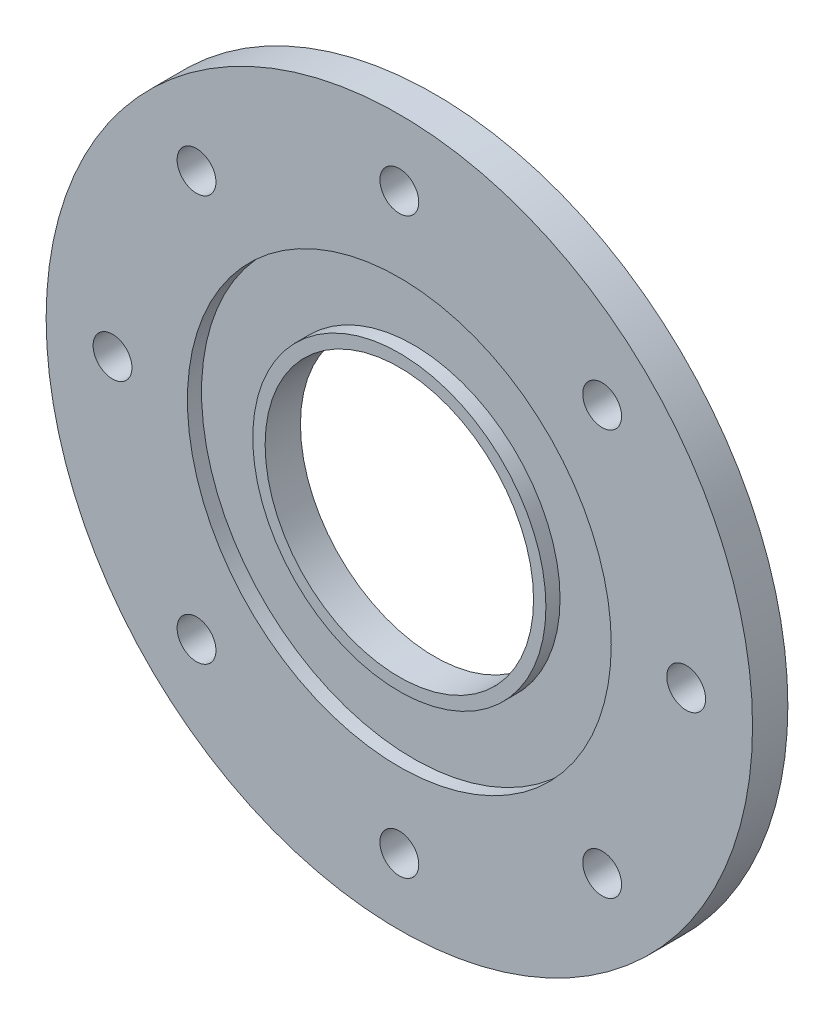
ISO-10303-21;
HEADER;
FILE_DESCRIPTION(('STEP AP214'),'2;1');
FILE_NAME('part.step','',(''),(''),'','','');
FILE_SCHEMA(('AUTOMOTIVE_DESIGN { 1 0 10303 214 1 1 1 1 }'));
ENDSEC;
DATA;
#1=APPLICATION_CONTEXT('core data for automotive mechanical design processes');
#2=APPLICATION_PROTOCOL_DEFINITION('international standard','automotive_design',2000,#1);
#3=PRODUCT_CONTEXT('',#1,'mechanical');
#4=PRODUCT('Part','Part','',(#3));
#5=PRODUCT_RELATED_PRODUCT_CATEGORY('part','',(#4));
#6=PRODUCT_DEFINITION_FORMATION('','',#4);
#7=PRODUCT_DEFINITION_CONTEXT('part definition',#1,'design');
#8=PRODUCT_DEFINITION('design','',#6,#7);
#9=PRODUCT_DEFINITION_SHAPE('','',#8);
#10=(LENGTH_UNIT() NAMED_UNIT(*) SI_UNIT(.MILLI.,.METRE.));
#11=(NAMED_UNIT(*) PLANE_ANGLE_UNIT() SI_UNIT($,.RADIAN.));
#12=(NAMED_UNIT(*) SI_UNIT($,.STERADIAN.) SOLID_ANGLE_UNIT());
#13=UNCERTAINTY_MEASURE_WITH_UNIT(LENGTH_MEASURE(1.E-05),#10,'distance_accuracy_value','');
#14=(GEOMETRIC_REPRESENTATION_CONTEXT(3) GLOBAL_UNCERTAINTY_ASSIGNED_CONTEXT((#13)) GLOBAL_UNIT_ASSIGNED_CONTEXT((#10,
#11,#12)) REPRESENTATION_CONTEXT('',''));
#15=CARTESIAN_POINT('',(0.,0.,0.));
#16=DIRECTION('',(0.,0.,1.));
#17=DIRECTION('',(1.,0.,0.));
#18=AXIS2_PLACEMENT_3D('',#15,#16,#17);
#19=CARTESIAN_POINT('',(0.,0.,5.));
#20=DIRECTION('',(0.,0.,1.));
#21=DIRECTION('',(1.,0.,0.));
#22=AXIS2_PLACEMENT_3D('',#19,#20,#21);
#23=PLANE('',#22);
#24=CARTESIAN_POINT('',(0.,0.,5.));
#25=DIRECTION('',(0.,0.,1.));
#26=DIRECTION('',(1.,0.,0.));
#27=AXIS2_PLACEMENT_3D('',#24,#25,#26);
#28=CIRCLE('',#27,19.);
#29=CARTESIAN_POINT('',(19.,0.,5.));
#30=VERTEX_POINT('',#29);
#31=EDGE_CURVE('E41',#30,#30,#28,.T.);
#32=ORIENTED_EDGE('',*,*,#31,.F.);
#33=EDGE_LOOP('',(#32));
#34=FACE_BOUND('',#33,.T.);
#35=CARTESIAN_POINT('',(0.,0.,5.));
#36=DIRECTION('',(0.,0.,1.));
#37=DIRECTION('',(1.,0.,0.));
#38=AXIS2_PLACEMENT_3D('',#35,#36,#37);
#39=CIRCLE('',#38,20.75);
#40=CARTESIAN_POINT('',(20.75,0.,5.));
#41=VERTEX_POINT('',#40);
#42=EDGE_CURVE('E55',#41,#41,#39,.T.);
#43=ORIENTED_EDGE('',*,*,#42,.T.);
#44=EDGE_LOOP('',(#43));
#45=FACE_BOUND('',#44,.T.);
#46=ADVANCED_FACE('F30',(#34,#45),#23,.T.);
#47=CARTESIAN_POINT('',(28.7106551721743,-28.7106551721744,5.));
#48=DIRECTION('',(0.,0.,1.));
#49=DIRECTION('',(1.,0.,0.));
#50=AXIS2_PLACEMENT_3D('',#47,#48,#49);
#51=CIRCLE('',#50,2.75);
#52=CARTESIAN_POINT('',(31.4606551721743,-28.7106551721744,5.));
#53=VERTEX_POINT('',#52);
#54=EDGE_CURVE('E102',#53,#53,#51,.T.);
#55=ORIENTED_EDGE('',*,*,#54,.F.);
#56=EDGE_LOOP('',(#55));
#57=FACE_BOUND('',#56,.T.);
#58=CARTESIAN_POINT('',(-1.41764609570561E-13,-40.6029979291063,5.));
#59=DIRECTION('',(0.,0.,1.));
#60=DIRECTION('',(1.,0.,0.));
#61=AXIS2_PLACEMENT_3D('',#58,#59,#60);
#62=CIRCLE('',#61,2.75);
#63=CARTESIAN_POINT('',(2.74999999999986,-40.6029979291063,5.));
#64=VERTEX_POINT('',#63);
#65=EDGE_CURVE('E96',#64,#64,#62,.T.);
#66=ORIENTED_EDGE('',*,*,#65,.F.);
#67=EDGE_LOOP('',(#66));
#68=FACE_BOUND('',#67,.T.);
#69=CARTESIAN_POINT('',(-28.7106551721745,-28.7106551721742,5.));
#70=DIRECTION('',(0.,0.,1.));
#71=DIRECTION('',(1.,0.,0.));
#72=AXIS2_PLACEMENT_3D('',#69,#70,#71);
#73=CIRCLE('',#72,2.75);
#74=CARTESIAN_POINT('',(-25.9606551721745,-28.7106551721742,5.));
#75=VERTEX_POINT('',#74);
#76=EDGE_CURVE('E90',#75,#75,#73,.T.);
#77=ORIENTED_EDGE('',*,*,#76,.F.);
#78=EDGE_LOOP('',(#77));
#79=FACE_BOUND('',#78,.T.);
#80=CARTESIAN_POINT('',(-40.6029979291063,2.83529219141122E-13,5.));
#81=DIRECTION('',(0.,0.,1.));
#82=DIRECTION('',(1.,0.,0.));
#83=AXIS2_PLACEMENT_3D('',#80,#81,#82);
#84=CIRCLE('',#83,2.75);
#85=CARTESIAN_POINT('',(-37.8529979291063,2.83529219141122E-13,5.));
#86=VERTEX_POINT('',#85);
#87=EDGE_CURVE('E84',#86,#86,#84,.T.);
#88=ORIENTED_EDGE('',*,*,#87,.F.);
#89=EDGE_LOOP('',(#88));
#90=FACE_BOUND('',#89,.T.);
#91=CARTESIAN_POINT('',(-28.7106551721741,28.7106551721746,5.));
#92=DIRECTION('',(0.,0.,1.));
#93=DIRECTION('',(1.,0.,0.));
#94=AXIS2_PLACEMENT_3D('',#91,#92,#93);
#95=CIRCLE('',#94,2.75);
#96=CARTESIAN_POINT('',(-25.9606551721741,28.7106551721746,5.));
#97=VERTEX_POINT('',#96);
#98=EDGE_CURVE('E78',#97,#97,#95,.T.);
#99=ORIENTED_EDGE('',*,*,#98,.F.);
#100=EDGE_LOOP('',(#99));
#101=FACE_BOUND('',#100,.T.);
#102=CARTESIAN_POINT('',(4.25293828711683E-13,40.6029979291063,5.));
#103=DIRECTION('',(0.,0.,1.));
#104=DIRECTION('',(1.,0.,0.));
#105=AXIS2_PLACEMENT_3D('',#102,#103,#104);
#106=CIRCLE('',#105,2.75);
#107=CARTESIAN_POINT('',(2.75000000000043,40.6029979291063,5.));
#108=VERTEX_POINT('',#107);
#109=EDGE_CURVE('E72',#108,#108,#106,.T.);
#110=ORIENTED_EDGE('',*,*,#109,.F.);
#111=EDGE_LOOP('',(#110));
#112=FACE_BOUND('',#111,.T.);
#113=CARTESIAN_POINT('',(28.7106551721747,28.710655172174,5.));
#114=DIRECTION('',(0.,0.,1.));
#115=DIRECTION('',(1.,0.,0.));
#116=AXIS2_PLACEMENT_3D('',#113,#114,#115);
#117=CIRCLE('',#116,2.75);
#118=CARTESIAN_POINT('',(31.4606551721747,28.710655172174,5.));
#119=VERTEX_POINT('',#118);
#120=EDGE_CURVE('E66',#119,#119,#117,.T.);
#121=ORIENTED_EDGE('',*,*,#120,.F.);
#122=EDGE_LOOP('',(#121));
#123=FACE_BOUND('',#122,.T.);
#124=CARTESIAN_POINT('',(40.6029979291063,0.,5.));
#125=DIRECTION('',(0.,0.,1.));
#126=DIRECTION('',(1.,0.,0.));
#127=AXIS2_PLACEMENT_3D('',#124,#125,#126);
#128=CIRCLE('',#127,2.75);
#129=CARTESIAN_POINT('',(43.3529979291063,0.,5.));
#130=VERTEX_POINT('',#129);
#131=EDGE_CURVE('E63',#130,#130,#128,.T.);
#132=ORIENTED_EDGE('',*,*,#131,.F.);
#133=EDGE_LOOP('',(#132));
#134=FACE_BOUND('',#133,.T.);
#135=CARTESIAN_POINT('',(0.,0.,5.));
#136=DIRECTION('',(0.,0.,1.));
#137=DIRECTION('',(1.,0.,0.));
#138=AXIS2_PLACEMENT_3D('',#135,#136,#137);
#139=CIRCLE('',#138,30.);
#140=CARTESIAN_POINT('',(30.,0.,5.));
#141=VERTEX_POINT('',#140);
#142=EDGE_CURVE('E49',#141,#141,#139,.T.);
#143=ORIENTED_EDGE('',*,*,#142,.F.);
#144=EDGE_LOOP('',(#143));
#145=FACE_BOUND('',#144,.T.);
#146=CARTESIAN_POINT('',(0.,0.,5.));
#147=DIRECTION('',(0.,0.,1.));
#148=DIRECTION('',(1.,0.,0.));
#149=AXIS2_PLACEMENT_3D('',#146,#147,#148);
#150=CIRCLE('',#149,50.);
#151=CARTESIAN_POINT('',(50.,0.,5.));
#152=VERTEX_POINT('',#151);
#153=EDGE_CURVE('E10',#152,#152,#150,.T.);
#154=ORIENTED_EDGE('',*,*,#153,.T.);
#155=EDGE_LOOP('',(#154));
#156=FACE_BOUND('',#155,.T.);
#157=ADVANCED_FACE('F115',(#57,#68,#79,#90,#101,#112,#123,#134,#145,#156),#23,.T.);
#158=CARTESIAN_POINT('',(0.,0.,0.));
#159=DIRECTION('',(0.,0.,1.));
#160=DIRECTION('',(1.,0.,0.));
#161=AXIS2_PLACEMENT_3D('',#158,#159,#160);
#162=PLANE('',#161);
#163=CARTESIAN_POINT('',(28.7106551721743,-28.7106551721744,0.));
#164=DIRECTION('',(0.,0.,1.));
#165=DIRECTION('',(1.,0.,0.));
#166=AXIS2_PLACEMENT_3D('',#163,#164,#165);
#167=CIRCLE('',#166,2.75);
#168=CARTESIAN_POINT('',(31.4606551721743,-28.7106551721744,0.));
#169=VERTEX_POINT('',#168);
#170=EDGE_CURVE('E105',#169,#169,#167,.F.);
#171=ORIENTED_EDGE('',*,*,#170,.F.);
#172=EDGE_LOOP('',(#171));
#173=FACE_BOUND('',#172,.T.);
#174=CARTESIAN_POINT('',(-1.41764609570561E-13,-40.6029979291063,0.));
#175=DIRECTION('',(0.,0.,1.));
#176=DIRECTION('',(1.,0.,0.));
#177=AXIS2_PLACEMENT_3D('',#174,#175,#176);
#178=CIRCLE('',#177,2.75);
#179=CARTESIAN_POINT('',(2.74999999999986,-40.6029979291063,0.));
#180=VERTEX_POINT('',#179);
#181=EDGE_CURVE('E99',#180,#180,#178,.F.);
#182=ORIENTED_EDGE('',*,*,#181,.F.);
#183=EDGE_LOOP('',(#182));
#184=FACE_BOUND('',#183,.T.);
#185=CARTESIAN_POINT('',(-28.7106551721745,-28.7106551721742,0.));
#186=DIRECTION('',(0.,0.,1.));
#187=DIRECTION('',(1.,0.,0.));
#188=AXIS2_PLACEMENT_3D('',#185,#186,#187);
#189=CIRCLE('',#188,2.75);
#190=CARTESIAN_POINT('',(-25.9606551721745,-28.7106551721742,0.));
#191=VERTEX_POINT('',#190);
#192=EDGE_CURVE('E93',#191,#191,#189,.F.);
#193=ORIENTED_EDGE('',*,*,#192,.F.);
#194=EDGE_LOOP('',(#193));
#195=FACE_BOUND('',#194,.T.);
#196=CARTESIAN_POINT('',(-40.6029979291063,2.83529219141122E-13,0.));
#197=DIRECTION('',(0.,0.,1.));
#198=DIRECTION('',(1.,0.,0.));
#199=AXIS2_PLACEMENT_3D('',#196,#197,#198);
#200=CIRCLE('',#199,2.75);
#201=CARTESIAN_POINT('',(-37.8529979291063,2.83529219141122E-13,0.));
#202=VERTEX_POINT('',#201);
#203=EDGE_CURVE('E87',#202,#202,#200,.F.);
#204=ORIENTED_EDGE('',*,*,#203,.F.);
#205=EDGE_LOOP('',(#204));
#206=FACE_BOUND('',#205,.T.);
#207=CARTESIAN_POINT('',(-28.7106551721741,28.7106551721746,0.));
#208=DIRECTION('',(0.,0.,1.));
#209=DIRECTION('',(1.,0.,0.));
#210=AXIS2_PLACEMENT_3D('',#207,#208,#209);
#211=CIRCLE('',#210,2.75);
#212=CARTESIAN_POINT('',(-25.9606551721741,28.7106551721746,0.));
#213=VERTEX_POINT('',#212);
#214=EDGE_CURVE('E81',#213,#213,#211,.F.);
#215=ORIENTED_EDGE('',*,*,#214,.F.);
#216=EDGE_LOOP('',(#215));
#217=FACE_BOUND('',#216,.T.);
#218=CARTESIAN_POINT('',(4.25293828711683E-13,40.6029979291063,0.));
#219=DIRECTION('',(0.,0.,1.));
#220=DIRECTION('',(1.,0.,0.));
#221=AXIS2_PLACEMENT_3D('',#218,#219,#220);
#222=CIRCLE('',#221,2.75);
#223=CARTESIAN_POINT('',(2.75000000000043,40.6029979291063,0.));
#224=VERTEX_POINT('',#223);
#225=EDGE_CURVE('E75',#224,#224,#222,.F.);
#226=ORIENTED_EDGE('',*,*,#225,.F.);
#227=EDGE_LOOP('',(#226));
#228=FACE_BOUND('',#227,.T.);
#229=CARTESIAN_POINT('',(28.7106551721747,28.710655172174,0.));
#230=DIRECTION('',(0.,0.,1.));
#231=DIRECTION('',(1.,0.,0.));
#232=AXIS2_PLACEMENT_3D('',#229,#230,#231);
#233=CIRCLE('',#232,2.75);
#234=CARTESIAN_POINT('',(31.4606551721747,28.710655172174,0.));
#235=VERTEX_POINT('',#234);
#236=EDGE_CURVE('E69',#235,#235,#233,.F.);
#237=ORIENTED_EDGE('',*,*,#236,.F.);
#238=EDGE_LOOP('',(#237));
#239=FACE_BOUND('',#238,.T.);
#240=CARTESIAN_POINT('',(40.6029979291063,0.,0.));
#241=DIRECTION('',(0.,0.,1.));
#242=DIRECTION('',(1.,0.,0.));
#243=AXIS2_PLACEMENT_3D('',#240,#241,#242);
#244=CIRCLE('',#243,2.75);
#245=CARTESIAN_POINT('',(43.3529979291063,0.,0.));
#246=VERTEX_POINT('',#245);
#247=EDGE_CURVE('E58',#246,#246,#244,.F.);
#248=ORIENTED_EDGE('',*,*,#247,.F.);
#249=EDGE_LOOP('',(#248));
#250=FACE_BOUND('',#249,.T.);
#251=CARTESIAN_POINT('',(0.,0.,0.));
#252=DIRECTION('',(0.,0.,1.));
#253=DIRECTION('',(1.,0.,0.));
#254=AXIS2_PLACEMENT_3D('',#251,#252,#253);
#255=CIRCLE('',#254,50.);
#256=CARTESIAN_POINT('',(50.,0.,0.));
#257=VERTEX_POINT('',#256);
#258=EDGE_CURVE('E34',#257,#257,#255,.T.);
#259=ORIENTED_EDGE('',*,*,#258,.F.);
#260=EDGE_LOOP('',(#259));
#261=FACE_BOUND('',#260,.T.);
#262=CARTESIAN_POINT('',(0.,0.,0.));
#263=DIRECTION('',(0.,0.,1.));
#264=DIRECTION('',(1.,0.,0.));
#265=AXIS2_PLACEMENT_3D('',#262,#263,#264);
#266=CIRCLE('',#265,19.);
#267=CARTESIAN_POINT('',(19.,0.,0.));
#268=VERTEX_POINT('',#267);
#269=EDGE_CURVE('E43',#268,#268,#266,.T.);
#270=ORIENTED_EDGE('',*,*,#269,.T.);
#271=EDGE_LOOP('',(#270));
#272=FACE_BOUND('',#271,.T.);
#273=ADVANCED_FACE('F112',(#173,#184,#195,#206,#217,#228,#239,#250,#261,#272),#162,.F.);
#274=CARTESIAN_POINT('',(0.,0.,5.));
#275=DIRECTION('',(0.,0.,-1.));
#276=DIRECTION('',(-1.,0.,0.));
#277=AXIS2_PLACEMENT_3D('',#274,#275,#276);
#278=CYLINDRICAL_SURFACE('',#277,50.);
#279=ORIENTED_EDGE('',*,*,#153,.F.);
#280=EDGE_LOOP('',(#279));
#281=FACE_BOUND('',#280,.T.);
#282=ORIENTED_EDGE('',*,*,#258,.T.);
#283=EDGE_LOOP('',(#282));
#284=FACE_BOUND('',#283,.T.);
#285=ADVANCED_FACE('F32',(#281,#284),#278,.T.);
#286=CARTESIAN_POINT('',(0.,0.,5.));
#287=DIRECTION('',(0.,0.,-1.));
#288=DIRECTION('',(-1.,0.,0.));
#289=AXIS2_PLACEMENT_3D('',#286,#287,#288);
#290=CYLINDRICAL_SURFACE('',#289,19.);
#291=ORIENTED_EDGE('',*,*,#31,.T.);
#292=EDGE_LOOP('',(#291));
#293=FACE_BOUND('',#292,.T.);
#294=ORIENTED_EDGE('',*,*,#269,.F.);
#295=EDGE_LOOP('',(#294));
#296=FACE_BOUND('',#295,.T.);
#297=ADVANCED_FACE('F134',(#293,#296),#290,.F.);
#298=CARTESIAN_POINT('',(0.,0.,3.));
#299=DIRECTION('',(0.,0.,1.));
#300=DIRECTION('',(1.,0.,0.));
#301=AXIS2_PLACEMENT_3D('',#298,#299,#300);
#302=CYLINDRICAL_SURFACE('',#301,30.);
#303=CARTESIAN_POINT('',(0.,0.,3.));
#304=DIRECTION('',(0.,0.,1.));
#305=DIRECTION('',(1.,0.,0.));
#306=AXIS2_PLACEMENT_3D('',#303,#304,#305);
#307=CIRCLE('',#306,30.);
#308=CARTESIAN_POINT('',(30.,0.,3.));
#309=VERTEX_POINT('',#308);
#310=EDGE_CURVE('E46',#309,#309,#307,.T.);
#311=ORIENTED_EDGE('',*,*,#310,.F.);
#312=EDGE_LOOP('',(#311));
#313=FACE_BOUND('',#312,.T.);
#314=ORIENTED_EDGE('',*,*,#142,.T.);
#315=EDGE_LOOP('',(#314));
#316=FACE_BOUND('',#315,.T.);
#317=ADVANCED_FACE('F136',(#313,#316),#302,.F.);
#318=CARTESIAN_POINT('',(0.,0.,3.));
#319=DIRECTION('',(0.,0.,1.));
#320=DIRECTION('',(1.,0.,0.));
#321=AXIS2_PLACEMENT_3D('',#318,#319,#320);
#322=PLANE('',#321);
#323=CARTESIAN_POINT('',(0.,0.,3.));
#324=DIRECTION('',(0.,0.,1.));
#325=DIRECTION('',(1.,0.,0.));
#326=AXIS2_PLACEMENT_3D('',#323,#324,#325);
#327=CIRCLE('',#326,20.75);
#328=CARTESIAN_POINT('',(20.75,0.,3.));
#329=VERTEX_POINT('',#328);
#330=EDGE_CURVE('E52',#329,#329,#327,.T.);
#331=ORIENTED_EDGE('',*,*,#330,.F.);
#332=EDGE_LOOP('',(#331));
#333=FACE_BOUND('',#332,.T.);
#334=ORIENTED_EDGE('',*,*,#310,.T.);
#335=EDGE_LOOP('',(#334));
#336=FACE_BOUND('',#335,.T.);
#337=ADVANCED_FACE('F143',(#333,#336),#322,.T.);
#338=CARTESIAN_POINT('',(0.,0.,3.));
#339=DIRECTION('',(0.,0.,1.));
#340=DIRECTION('',(1.,0.,0.));
#341=AXIS2_PLACEMENT_3D('',#338,#339,#340);
#342=CYLINDRICAL_SURFACE('',#341,20.75);
#343=ORIENTED_EDGE('',*,*,#330,.T.);
#344=EDGE_LOOP('',(#343));
#345=FACE_BOUND('',#344,.T.);
#346=ORIENTED_EDGE('',*,*,#42,.F.);
#347=EDGE_LOOP('',(#346));
#348=FACE_BOUND('',#347,.T.);
#349=ADVANCED_FACE('F158',(#345,#348),#342,.T.);
#350=CARTESIAN_POINT('',(40.6029979291063,0.,-7.77817459305203));
#351=DIRECTION('',(0.,0.,1.));
#352=DIRECTION('',(1.,0.,0.));
#353=AXIS2_PLACEMENT_3D('',#350,#351,#352);
#354=CYLINDRICAL_SURFACE('',#353,2.75);
#355=ORIENTED_EDGE('',*,*,#247,.T.);
#356=EDGE_LOOP('',(#355));
#357=FACE_BOUND('',#356,.T.);
#358=ORIENTED_EDGE('',*,*,#131,.T.);
#359=EDGE_LOOP('',(#358));
#360=FACE_BOUND('',#359,.T.);
#361=ADVANCED_FACE('F160',(#357,#360),#354,.F.);
#362=CARTESIAN_POINT('',(28.7106551721747,28.710655172174,-7.77817459305203));
#363=DIRECTION('',(0.,0.,1.));
#364=DIRECTION('',(1.,0.,0.));
#365=AXIS2_PLACEMENT_3D('',#362,#363,#364);
#366=CYLINDRICAL_SURFACE('',#365,2.75);
#367=ORIENTED_EDGE('',*,*,#236,.T.);
#368=EDGE_LOOP('',(#367));
#369=FACE_BOUND('',#368,.T.);
#370=ORIENTED_EDGE('',*,*,#120,.T.);
#371=EDGE_LOOP('',(#370));
#372=FACE_BOUND('',#371,.T.);
#373=ADVANCED_FACE('F167',(#369,#372),#366,.F.);
#374=CARTESIAN_POINT('',(4.25293828711683E-13,40.6029979291063,-7.77817459305203));
#375=DIRECTION('',(0.,0.,1.));
#376=DIRECTION('',(1.,0.,0.));
#377=AXIS2_PLACEMENT_3D('',#374,#375,#376);
#378=CYLINDRICAL_SURFACE('',#377,2.75);
#379=ORIENTED_EDGE('',*,*,#225,.T.);
#380=EDGE_LOOP('',(#379));
#381=FACE_BOUND('',#380,.T.);
#382=ORIENTED_EDGE('',*,*,#109,.T.);
#383=EDGE_LOOP('',(#382));
#384=FACE_BOUND('',#383,.T.);
#385=ADVANCED_FACE('F175',(#381,#384),#378,.F.);
#386=CARTESIAN_POINT('',(-28.7106551721741,28.7106551721746,-7.77817459305203));
#387=DIRECTION('',(0.,0.,1.));
#388=DIRECTION('',(1.,0.,0.));
#389=AXIS2_PLACEMENT_3D('',#386,#387,#388);
#390=CYLINDRICAL_SURFACE('',#389,2.75);
#391=ORIENTED_EDGE('',*,*,#214,.T.);
#392=EDGE_LOOP('',(#391));
#393=FACE_BOUND('',#392,.T.);
#394=ORIENTED_EDGE('',*,*,#98,.T.);
#395=EDGE_LOOP('',(#394));
#396=FACE_BOUND('',#395,.T.);
#397=ADVANCED_FACE('F179',(#393,#396),#390,.F.);
#398=CARTESIAN_POINT('',(-40.6029979291063,2.83529219141122E-13,-7.77817459305203));
#399=DIRECTION('',(0.,0.,1.));
#400=DIRECTION('',(1.,0.,0.));
#401=AXIS2_PLACEMENT_3D('',#398,#399,#400);
#402=CYLINDRICAL_SURFACE('',#401,2.75);
#403=ORIENTED_EDGE('',*,*,#203,.T.);
#404=EDGE_LOOP('',(#403));
#405=FACE_BOUND('',#404,.T.);
#406=ORIENTED_EDGE('',*,*,#87,.T.);
#407=EDGE_LOOP('',(#406));
#408=FACE_BOUND('',#407,.T.);
#409=ADVANCED_FACE('F183',(#405,#408),#402,.F.);
#410=CARTESIAN_POINT('',(-28.7106551721745,-28.7106551721742,-7.77817459305203));
#411=DIRECTION('',(0.,0.,1.));
#412=DIRECTION('',(1.,0.,0.));
#413=AXIS2_PLACEMENT_3D('',#410,#411,#412);
#414=CYLINDRICAL_SURFACE('',#413,2.75);
#415=ORIENTED_EDGE('',*,*,#192,.T.);
#416=EDGE_LOOP('',(#415));
#417=FACE_BOUND('',#416,.T.);
#418=ORIENTED_EDGE('',*,*,#76,.T.);
#419=EDGE_LOOP('',(#418));
#420=FACE_BOUND('',#419,.T.);
#421=ADVANCED_FACE('F187',(#417,#420),#414,.F.);
#422=CARTESIAN_POINT('',(-1.41764609570561E-13,-40.6029979291063,-7.77817459305203));
#423=DIRECTION('',(0.,0.,1.));
#424=DIRECTION('',(1.,0.,0.));
#425=AXIS2_PLACEMENT_3D('',#422,#423,#424);
#426=CYLINDRICAL_SURFACE('',#425,2.75);
#427=ORIENTED_EDGE('',*,*,#181,.T.);
#428=EDGE_LOOP('',(#427));
#429=FACE_BOUND('',#428,.T.);
#430=ORIENTED_EDGE('',*,*,#65,.T.);
#431=EDGE_LOOP('',(#430));
#432=FACE_BOUND('',#431,.T.);
#433=ADVANCED_FACE('F191',(#429,#432),#426,.F.);
#434=CARTESIAN_POINT('',(28.7106551721743,-28.7106551721744,-7.77817459305203));
#435=DIRECTION('',(0.,0.,1.));
#436=DIRECTION('',(1.,0.,0.));
#437=AXIS2_PLACEMENT_3D('',#434,#435,#436);
#438=CYLINDRICAL_SURFACE('',#437,2.75);
#439=ORIENTED_EDGE('',*,*,#170,.T.);
#440=EDGE_LOOP('',(#439));
#441=FACE_BOUND('',#440,.T.);
#442=ORIENTED_EDGE('',*,*,#54,.T.);
#443=EDGE_LOOP('',(#442));
#444=FACE_BOUND('',#443,.T.);
#445=ADVANCED_FACE('F109',(#441,#444),#438,.F.);
#446=CLOSED_SHELL('',(#46,#157,#273,#285,#297,#317,#337,#349,#361,#373,#385,#397,#409,#421,#433,#445));
#447=MANIFOLD_SOLID_BREP('B2',#446);
#448=ADVANCED_BREP_SHAPE_REPRESENTATION('',(#18,#447),#14);
#449=SHAPE_DEFINITION_REPRESENTATION(#9,#448);
ENDSEC;
END-ISO-10303-21;
